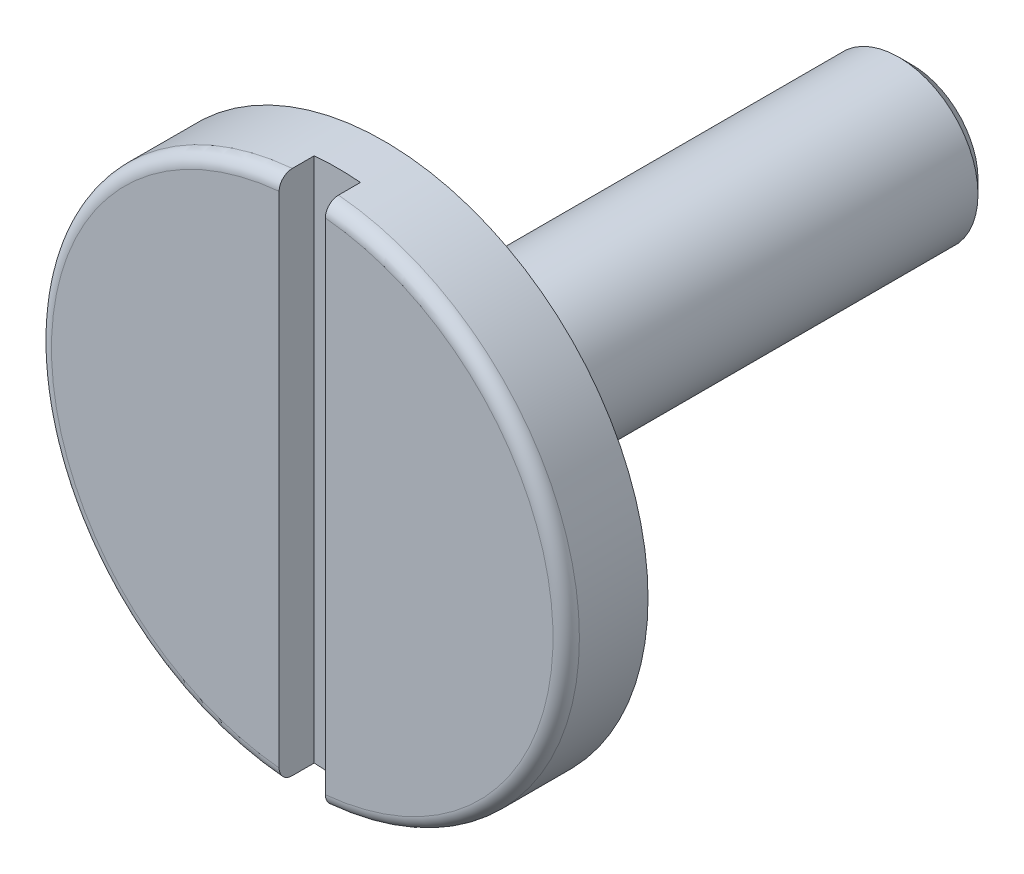
ISO-10303-21;
HEADER;
FILE_DESCRIPTION(('STEP AP214'),'2;1');
FILE_NAME('part.step','',(''),(''),'','','');
FILE_SCHEMA(('AUTOMOTIVE_DESIGN { 1 0 10303 214 1 1 1 1 }'));
ENDSEC;
DATA;
#1=APPLICATION_CONTEXT('core data for automotive mechanical design processes');
#2=APPLICATION_PROTOCOL_DEFINITION('international standard','automotive_design',2000,#1);
#3=PRODUCT_CONTEXT('',#1,'mechanical');
#4=PRODUCT('Part','Part','',(#3));
#5=PRODUCT_RELATED_PRODUCT_CATEGORY('part','',(#4));
#6=PRODUCT_DEFINITION_FORMATION('','',#4);
#7=PRODUCT_DEFINITION_CONTEXT('part definition',#1,'design');
#8=PRODUCT_DEFINITION('design','',#6,#7);
#9=PRODUCT_DEFINITION_SHAPE('','',#8);
#10=(LENGTH_UNIT() NAMED_UNIT(*) SI_UNIT(.MILLI.,.METRE.));
#11=(NAMED_UNIT(*) PLANE_ANGLE_UNIT() SI_UNIT($,.RADIAN.));
#12=(NAMED_UNIT(*) SI_UNIT($,.STERADIAN.) SOLID_ANGLE_UNIT());
#13=UNCERTAINTY_MEASURE_WITH_UNIT(LENGTH_MEASURE(1.E-05),#10,'distance_accuracy_value','');
#14=(GEOMETRIC_REPRESENTATION_CONTEXT(3) GLOBAL_UNCERTAINTY_ASSIGNED_CONTEXT((#13)) GLOBAL_UNIT_ASSIGNED_CONTEXT((#10,
#11,#12)) REPRESENTATION_CONTEXT('',''));
#15=CARTESIAN_POINT('',(0.,0.,0.));
#16=DIRECTION('',(0.,0.,1.));
#17=DIRECTION('',(1.,0.,0.));
#18=AXIS2_PLACEMENT_3D('',#15,#16,#17);
#19=CARTESIAN_POINT('',(0.,0.,3.1));
#20=DIRECTION('',(0.,0.,-1.));
#21=DIRECTION('',(-1.,0.,0.));
#22=AXIS2_PLACEMENT_3D('',#19,#20,#21);
#23=PLANE('',#22);
#24=DIRECTION('',(0.,1.,0.));
#25=VECTOR('',#24,1.);
#26=CARTESIAN_POINT('',(0.875000000000002,-9.96164519544839,3.1));
#27=LINE('',#26,#25);
#28=CARTESIAN_POINT('',(0.874999999999999,9.45961812125627,3.1));
#29=VERTEX_POINT('',#28);
#30=CARTESIAN_POINT('',(0.875000000000001,-9.45961812125627,3.1));
#31=VERTEX_POINT('',#30);
#32=EDGE_CURVE('E78',#29,#31,#27,.F.);
#33=ORIENTED_EDGE('',*,*,#32,.T.);
#34=CARTESIAN_POINT('',(0.,0.,3.1));
#35=DIRECTION('',(0.,0.,-1.));
#36=DIRECTION('',(0.0921052631578945,0.995749275921713,0.));
#37=AXIS2_PLACEMENT_3D('',#34,#35,#36);
#38=CIRCLE('',#37,9.5);
#39=EDGE_CURVE('E90',#29,#31,#38,.T.);
#40=ORIENTED_EDGE('',*,*,#39,.F.);
#41=EDGE_LOOP('',(#33,#40));
#42=FACE_BOUND('',#41,.T.);
#43=ADVANCED_FACE('F15',(#42),#23,.F.);
#44=CARTESIAN_POINT('',(0.,0.,3.1));
#45=DIRECTION('',(0.,0.,-1.));
#46=DIRECTION('',(-1.,0.,0.));
#47=AXIS2_PLACEMENT_3D('',#44,#45,#46);
#48=PLANE('',#47);
#49=DIRECTION('',(0.,1.,0.));
#50=VECTOR('',#49,1.);
#51=CARTESIAN_POINT('',(-0.875000000000003,9.96164519544839,3.1));
#52=LINE('',#51,#50);
#53=CARTESIAN_POINT('',(-0.875000000000001,-9.45961812125627,3.1));
#54=VERTEX_POINT('',#53);
#55=CARTESIAN_POINT('',(-0.875000000000003,9.45961812125627,3.1));
#56=VERTEX_POINT('',#55);
#57=EDGE_CURVE('E69',#54,#56,#52,.T.);
#58=ORIENTED_EDGE('',*,*,#57,.T.);
#59=CARTESIAN_POINT('',(0.,0.,3.1));
#60=DIRECTION('',(0.,0.,-1.));
#61=DIRECTION('',(-0.0921052631578946,-0.995749275921713,0.));
#62=AXIS2_PLACEMENT_3D('',#59,#60,#61);
#63=CIRCLE('',#62,9.5);
#64=EDGE_CURVE('E146',#54,#56,#63,.T.);
#65=ORIENTED_EDGE('',*,*,#64,.F.);
#66=EDGE_LOOP('',(#58,#65));
#67=FACE_BOUND('',#66,.T.);
#68=ADVANCED_FACE('F151',(#67),#48,.F.);
#69=CARTESIAN_POINT('',(0.875000000000002,-9.96164519544839,3.1));
#70=DIRECTION('',(1.,0.,0.));
#71=DIRECTION('',(0.,0.,-1.));
#72=AXIS2_PLACEMENT_3D('',#69,#70,#71);
#73=PLANE('',#72);
#74=DIRECTION('',(0.,0.,-1.));
#75=VECTOR('',#74,1.);
#76=CARTESIAN_POINT('',(0.875000000000002,9.96164519544839,3.1));
#77=LINE('',#76,#75);
#78=CARTESIAN_POINT('',(0.875000000000002,9.96164519544839,1.77));
#79=VERTEX_POINT('',#78);
#80=CARTESIAN_POINT('',(0.875000000000001,9.96164519544839,2.6));
#81=VERTEX_POINT('',#80);
#82=EDGE_CURVE('E39',#79,#81,#77,.F.);
#83=ORIENTED_EDGE('',*,*,#82,.F.);
#84=DIRECTION('',(0.,1.,0.));
#85=VECTOR('',#84,1.);
#86=CARTESIAN_POINT('',(0.875000000000002,0.,1.77));
#87=LINE('',#86,#85);
#88=CARTESIAN_POINT('',(0.875000000000002,-9.96164519544839,1.77));
#89=VERTEX_POINT('',#88);
#90=EDGE_CURVE('E200',#89,#79,#87,.T.);
#91=ORIENTED_EDGE('',*,*,#90,.F.);
#92=DIRECTION('',(0.,0.,-1.));
#93=VECTOR('',#92,1.);
#94=CARTESIAN_POINT('',(0.875000000000002,-9.96164519544839,3.1));
#95=LINE('',#94,#93);
#96=CARTESIAN_POINT('',(0.875000000000004,-9.96164519544839,2.6));
#97=VERTEX_POINT('',#96);
#98=EDGE_CURVE('E88',#97,#89,#95,.T.);
#99=ORIENTED_EDGE('',*,*,#98,.F.);
#100=CARTESIAN_POINT('',(0.875,-9.45961812125627,3.1));
#101=CARTESIAN_POINT('',(0.875000000000738,-9.48794703213022,3.10002353735377));
#102=CARTESIAN_POINT('',(0.87500000000044,-9.51626965933769,3.09761422660844));
#103=CARTESIAN_POINT('',(0.874999999999565,-9.57209714343182,3.0881014517241));
#104=CARTESIAN_POINT('',(0.874999999998988,-9.59960252401443,3.08100106453784));
#105=CARTESIAN_POINT('',(0.874999999999346,-9.65304367864375,3.06227229782282));
#106=CARTESIAN_POINT('',(0.875000000000281,-9.67897861178497,3.05064151681156));
#107=CARTESIAN_POINT('',(0.874999999999723,-9.72851723708293,3.02318598945902));
#108=CARTESIAN_POINT('',(0.874999999998231,-9.75212142758174,3.00736214232483));
#109=CARTESIAN_POINT('',(0.874999999998479,-9.79628200801184,2.97199631232369));
#110=CARTESIAN_POINT('',(0.875000000000213,-9.81684423978009,2.95246162513349));
#111=CARTESIAN_POINT('',(0.874999999999791,-9.85438111181075,2.91020550095205));
#112=CARTESIAN_POINT('',(0.874999999997636,-9.87135593010147,2.88748422219116));
#113=CARTESIAN_POINT('',(0.874999999997825,-9.90117167292373,2.83958905671415));
#114=CARTESIAN_POINT('',(0.875000000000155,-9.91402701778687,2.8144241363582));
#115=CARTESIAN_POINT('',(0.874999999999849,-9.93530677214744,2.76229357758986));
#116=CARTESIAN_POINT('',(0.874999999997218,-9.94373402304016,2.73532910645484));
#117=CARTESIAN_POINT('',(0.874999999997662,-9.95375435926333,2.69015751267986));
#118=CARTESIAN_POINT('',(0.874999999999041,-9.95671165930196,2.67224132176447));
#119=CARTESIAN_POINT('',(0.875000000000961,-9.96065675374565,2.63621933188532));
#120=CARTESIAN_POINT('',(0.875000000001502,-9.96164735191317,2.61811383988958));
#121=CARTESIAN_POINT('',(0.875000000000007,-9.96164519544839,2.60000000000001));
#122=B_SPLINE_CURVE_WITH_KNOTS('',3,(#100,#101,#102,#103,#104,#105,#106,#107,#108,#109,#110,
#111,#112,#113,#114,#115,#116,#117,#118,#119,#120,#121),.UNSPECIFIED.,.F.,.F.,(4,2,2,2,2,2,2,2,
2,2,4),(0.,0.0848755954427187,0.169695574809206,0.25456057708415,0.339407394685175,
0.424089094519425,0.508766590967947,0.593144348713257,0.677467897073694,0.731843659457585,
0.786141847039047),.UNSPECIFIED.);
#123=EDGE_CURVE('E85',#31,#97,#122,.T.);
#124=ORIENTED_EDGE('',*,*,#123,.F.);
#125=ORIENTED_EDGE('',*,*,#32,.F.);
#126=CARTESIAN_POINT('',(0.875,9.96164519544839,2.6));
#127=CARTESIAN_POINT('',(0.875000000000003,9.96166951727,2.62804981859996));
#128=CARTESIAN_POINT('',(0.875000000000003,9.9592772046922,2.65609188700764));
#129=CARTESIAN_POINT('',(0.875000000000001,9.94983951248388,2.71135721970606));
#130=CARTESIAN_POINT('',(0.874999999999999,9.9427982806824,2.73858119129698));
#131=CARTESIAN_POINT('',(0.875,9.92423823906859,2.79147154113732));
#132=CARTESIAN_POINT('',(0.875000000000003,9.91271743965994,2.8171372214085));
#133=CARTESIAN_POINT('',(0.875000000000001,9.88554069307088,2.86617091219818));
#134=CARTESIAN_POINT('',(0.874999999999998,9.86988535217824,2.88953925890802));
#135=CARTESIAN_POINT('',(0.875000000000009,9.83485565060325,2.93336497990533));
#136=CARTESIAN_POINT('',(0.875000000000024,9.81547491969754,2.95381726200664));
#137=CARTESIAN_POINT('',(0.87499999999998,9.77356547207434,2.99119232559525));
#138=CARTESIAN_POINT('',(0.874999999999922,9.75103670370162,3.00811504915571));
#139=CARTESIAN_POINT('',(0.875000000000084,9.70337939877358,3.03802088902259));
#140=CARTESIAN_POINT('',(0.875000000000306,9.67824098253159,3.05098824356295));
#141=CARTESIAN_POINT('',(0.874999999999698,9.62615395533316,3.07253022659135));
#142=CARTESIAN_POINT('',(0.874999999998869,9.59920630228888,3.08110715919129));
#143=CARTESIAN_POINT('',(0.874999999999106,9.55335751097752,3.09156939508533));
#144=CARTESIAN_POINT('',(0.874999999999637,9.53473698640962,3.09472905226063));
#145=CARTESIAN_POINT('',(0.875000000000366,9.49728618011395,3.09894412897264));
#146=CARTESIAN_POINT('',(0.875000000000565,9.4784562347663,3.10000253795991));
#147=CARTESIAN_POINT('',(0.875,9.45961812125628,3.1));
#148=B_SPLINE_CURVE_WITH_KNOTS('',3,(#126,#127,#128,#129,#130,#131,#132,#133,#134,#135,#136,
#137,#138,#139,#140,#141,#142,#143,#144,#145,#146,#147),.UNSPECIFIED.,.F.,.F.,(4,2,2,2,2,2,2,2,
2,2,4),(0.,0.0840363990036681,0.167997920726342,0.251996776566993,0.335983321676738,
0.42011477791981,0.504247614813298,0.588711460220256,0.673130933082565,0.72968015961597,
0.786148875617127),.UNSPECIFIED.);
#149=EDGE_CURVE('E82',#81,#29,#148,.T.);
#150=ORIENTED_EDGE('',*,*,#149,.F.);
#151=EDGE_LOOP('',(#83,#91,#99,#124,#125,#150));
#152=FACE_BOUND('',#151,.T.);
#153=ADVANCED_FACE('F80',(#152),#73,.F.);
#154=CARTESIAN_POINT('',(-0.875000000000003,9.96164519544839,3.1));
#155=DIRECTION('',(-1.,0.,0.));
#156=DIRECTION('',(0.,0.,1.));
#157=AXIS2_PLACEMENT_3D('',#154,#155,#156);
#158=PLANE('',#157);
#159=DIRECTION('',(0.,0.,1.));
#160=VECTOR('',#159,1.);
#161=CARTESIAN_POINT('',(-0.875000000000003,-9.96164519544839,3.1));
#162=LINE('',#161,#160);
#163=CARTESIAN_POINT('',(-0.875000000000003,-9.96164519544839,1.77));
#164=VERTEX_POINT('',#163);
#165=CARTESIAN_POINT('',(-0.875000000000001,-9.96164519544839,2.6));
#166=VERTEX_POINT('',#165);
#167=EDGE_CURVE('E100',#164,#166,#162,.T.);
#168=ORIENTED_EDGE('',*,*,#167,.F.);
#169=DIRECTION('',(0.,1.,0.));
#170=VECTOR('',#169,1.);
#171=CARTESIAN_POINT('',(-0.875000000000003,0.,1.77));
#172=LINE('',#171,#170);
#173=CARTESIAN_POINT('',(-0.875000000000003,9.96164519544839,1.77));
#174=VERTEX_POINT('',#173);
#175=EDGE_CURVE('E132',#174,#164,#172,.F.);
#176=ORIENTED_EDGE('',*,*,#175,.F.);
#177=DIRECTION('',(0.,0.,1.));
#178=VECTOR('',#177,1.);
#179=CARTESIAN_POINT('',(-0.875000000000003,9.96164519544839,3.1));
#180=LINE('',#179,#178);
#181=CARTESIAN_POINT('',(-0.875000000000004,9.96164519544839,2.6));
#182=VERTEX_POINT('',#181);
#183=EDGE_CURVE('E134',#182,#174,#180,.F.);
#184=ORIENTED_EDGE('',*,*,#183,.F.);
#185=CARTESIAN_POINT('',(-0.875000000000002,9.45961812125627,3.1));
#186=CARTESIAN_POINT('',(-0.875000000000743,9.48794703213022,3.10002353735377));
#187=CARTESIAN_POINT('',(-0.875000000000443,9.51626965933769,3.09761422660844));
#188=CARTESIAN_POINT('',(-0.874999999999563,9.57209714343182,3.0881014517241));
#189=CARTESIAN_POINT('',(-0.874999999998984,9.59960252401443,3.08100106453784));
#190=CARTESIAN_POINT('',(-0.874999999999341,9.65304367864375,3.06227229782282));
#191=CARTESIAN_POINT('',(-0.875000000000279,9.67897861178497,3.05064151681156));
#192=CARTESIAN_POINT('',(-0.874999999999727,9.72851723708293,3.02318598945902));
#193=CARTESIAN_POINT('',(-0.874999999998238,9.75212142758174,3.00736214232483));
#194=CARTESIAN_POINT('',(-0.874999999998484,9.79628200801184,2.97199631232369));
#195=CARTESIAN_POINT('',(-0.875000000000214,9.81684423978009,2.95246162513349));
#196=CARTESIAN_POINT('',(-0.874999999999792,9.85438111181075,2.91020550095205));
#197=CARTESIAN_POINT('',(-0.874999999997642,9.87135593010147,2.88748422219116));
#198=CARTESIAN_POINT('',(-0.874999999997831,9.90117167292373,2.83958905671415));
#199=CARTESIAN_POINT('',(-0.875000000000155,9.91402701778686,2.8144241363582));
#200=CARTESIAN_POINT('',(-0.874999999999852,9.93530677214744,2.76229357758986));
#201=CARTESIAN_POINT('',(-0.874999999997228,9.94373402304016,2.73532910645484));
#202=CARTESIAN_POINT('',(-0.87499999999767,9.95375435926333,2.69015751267986));
#203=CARTESIAN_POINT('',(-0.874999999999046,9.95671165930196,2.67224132176447));
#204=CARTESIAN_POINT('',(-0.875000000000958,9.96065675374565,2.63621933188532));
#205=CARTESIAN_POINT('',(-0.875000000001495,9.96164735191317,2.61811383988958));
#206=CARTESIAN_POINT('',(-0.874999999999998,9.96164519544839,2.60000000000001));
#207=B_SPLINE_CURVE_WITH_KNOTS('',3,(#185,#186,#187,#188,#189,#190,#191,#192,#193,#194,#195,
#196,#197,#198,#199,#200,#201,#202,#203,#204,#205,#206),.UNSPECIFIED.,.F.,.F.,(4,2,2,2,2,2,2,2,
2,2,4),(0.,0.0848755954427187,0.169695574809206,0.254560577084148,0.339407394685173,
0.424089094519423,0.508766590967947,0.593144348713255,0.677467897073693,0.731843659457584,
0.786141847039046),.UNSPECIFIED.);
#208=EDGE_CURVE('E94',#56,#182,#207,.T.);
#209=ORIENTED_EDGE('',*,*,#208,.F.);
#210=ORIENTED_EDGE('',*,*,#57,.F.);
#211=CARTESIAN_POINT('',(-0.875,-9.96164519544839,2.6));
#212=CARTESIAN_POINT('',(-0.875000000000003,-9.96166951727,2.62804981859996));
#213=CARTESIAN_POINT('',(-0.875000000000003,-9.9592772046922,2.65609188700764));
#214=CARTESIAN_POINT('',(-0.875000000000003,-9.94983951248388,2.71135721970606));
#215=CARTESIAN_POINT('',(-0.875000000000002,-9.9427982806824,2.73858119129698));
#216=CARTESIAN_POINT('',(-0.875000000000002,-9.92423823906859,2.79147154113732));
#217=CARTESIAN_POINT('',(-0.875000000000003,-9.91271743965994,2.8171372214085));
#218=CARTESIAN_POINT('',(-0.875000000000003,-9.88554069307088,2.86617091219818));
#219=CARTESIAN_POINT('',(-0.875000000000003,-9.86988535217824,2.88953925890802));
#220=CARTESIAN_POINT('',(-0.875000000000015,-9.83485565060325,2.93336497990533));
#221=CARTESIAN_POINT('',(-0.875000000000028,-9.81547491969754,2.95381726200664));
#222=CARTESIAN_POINT('',(-0.874999999999978,-9.77356547207434,2.99119232559526));
#223=CARTESIAN_POINT('',(-0.874999999999914,-9.75103670370162,3.00811504915571));
#224=CARTESIAN_POINT('',(-0.875000000000077,-9.70337939877358,3.03802088902259));
#225=CARTESIAN_POINT('',(-0.875000000000305,-9.67824098253158,3.05098824356295));
#226=CARTESIAN_POINT('',(-0.874999999999702,-9.62615395533316,3.07253022659135));
#227=CARTESIAN_POINT('',(-0.874999999998872,-9.59920630228888,3.08110715919129));
#228=CARTESIAN_POINT('',(-0.874999999999108,-9.55335751097752,3.09156939508533));
#229=CARTESIAN_POINT('',(-0.874999999999639,-9.53473698640962,3.09472905226063));
#230=CARTESIAN_POINT('',(-0.875000000000367,-9.49728618011395,3.09894412897264));
#231=CARTESIAN_POINT('',(-0.875000000000564,-9.4784562347663,3.10000253795991));
#232=CARTESIAN_POINT('',(-0.874999999999995,-9.45961812125628,3.1));
#233=B_SPLINE_CURVE_WITH_KNOTS('',3,(#211,#212,#213,#214,#215,#216,#217,#218,#219,#220,#221,
#222,#223,#224,#225,#226,#227,#228,#229,#230,#231,#232),.UNSPECIFIED.,.F.,.F.,(4,2,2,2,2,2,2,2,
2,2,4),(0.,0.0840363990036681,0.167997920726342,0.251996776566994,0.335983321676739,
0.420114777919812,0.5042476148133,0.588711460220257,0.673130933082564,0.729680159615969,
0.786148875617127),.UNSPECIFIED.);
#234=EDGE_CURVE('E210',#166,#54,#233,.T.);
#235=ORIENTED_EDGE('',*,*,#234,.F.);
#236=EDGE_LOOP('',(#168,#176,#184,#209,#210,#235));
#237=FACE_BOUND('',#236,.T.);
#238=ADVANCED_FACE('F119',(#237),#158,.F.);
#239=CARTESIAN_POINT('',(0.,0.,2.6));
#240=DIRECTION('',(0.,0.,-1.));
#241=DIRECTION('',(-1.,0.,0.));
#242=AXIS2_PLACEMENT_3D('',#239,#240,#241);
#243=TOROIDAL_SURFACE('',#242,9.5,0.5);
#244=ORIENTED_EDGE('',*,*,#149,.T.);
#245=ORIENTED_EDGE('',*,*,#39,.T.);
#246=ORIENTED_EDGE('',*,*,#123,.T.);
#247=CARTESIAN_POINT('',(0.,0.,2.6));
#248=DIRECTION('',(0.,0.,1.));
#249=DIRECTION('',(1.,0.,0.));
#250=AXIS2_PLACEMENT_3D('',#247,#248,#249);
#251=CIRCLE('',#250,10.);
#252=EDGE_CURVE('E98',#81,#97,#251,.F.);
#253=ORIENTED_EDGE('',*,*,#252,.F.);
#254=EDGE_LOOP('',(#244,#245,#246,#253));
#255=FACE_BOUND('',#254,.T.);
#256=ADVANCED_FACE('F97',(#255),#243,.T.);
#257=CARTESIAN_POINT('',(0.,0.,2.6));
#258=DIRECTION('',(0.,0.,-1.));
#259=DIRECTION('',(-1.,0.,0.));
#260=AXIS2_PLACEMENT_3D('',#257,#258,#259);
#261=TOROIDAL_SURFACE('',#260,9.5,0.5);
#262=ORIENTED_EDGE('',*,*,#234,.T.);
#263=ORIENTED_EDGE('',*,*,#64,.T.);
#264=ORIENTED_EDGE('',*,*,#208,.T.);
#265=CARTESIAN_POINT('',(0.,0.,2.6));
#266=DIRECTION('',(0.,0.,1.));
#267=DIRECTION('',(1.,0.,0.));
#268=AXIS2_PLACEMENT_3D('',#265,#266,#267);
#269=CIRCLE('',#268,10.);
#270=EDGE_CURVE('E129',#166,#182,#269,.F.);
#271=ORIENTED_EDGE('',*,*,#270,.F.);
#272=EDGE_LOOP('',(#262,#263,#264,#271));
#273=FACE_BOUND('',#272,.T.);
#274=ADVANCED_FACE('F118',(#273),#261,.T.);
#275=CARTESIAN_POINT('',(0.,0.,1.77));
#276=DIRECTION('',(0.,0.,1.));
#277=DIRECTION('',(1.,0.,0.));
#278=AXIS2_PLACEMENT_3D('',#275,#276,#277);
#279=PLANE('',#278);
#280=CARTESIAN_POINT('',(0.,0.,1.77));
#281=DIRECTION('',(0.,0.,1.));
#282=DIRECTION('',(1.,0.,0.));
#283=AXIS2_PLACEMENT_3D('',#280,#281,#282);
#284=CIRCLE('',#283,10.);
#285=EDGE_CURVE('E196',#174,#79,#284,.F.);
#286=ORIENTED_EDGE('',*,*,#285,.F.);
#287=ORIENTED_EDGE('',*,*,#175,.T.);
#288=CARTESIAN_POINT('',(0.,0.,1.77));
#289=DIRECTION('',(0.,0.,1.));
#290=DIRECTION('',(1.,0.,0.));
#291=AXIS2_PLACEMENT_3D('',#288,#289,#290);
#292=CIRCLE('',#291,10.);
#293=EDGE_CURVE('E131',#89,#164,#292,.F.);
#294=ORIENTED_EDGE('',*,*,#293,.F.);
#295=ORIENTED_EDGE('',*,*,#90,.T.);
#296=EDGE_LOOP('',(#286,#287,#294,#295));
#297=FACE_BOUND('',#296,.T.);
#298=ADVANCED_FACE('F186',(#297),#279,.T.);
#299=CARTESIAN_POINT('',(0.,0.,0.));
#300=DIRECTION('',(0.,0.,1.));
#301=DIRECTION('',(1.,0.,0.));
#302=AXIS2_PLACEMENT_3D('',#299,#300,#301);
#303=CYLINDRICAL_SURFACE('',#302,10.);
#304=CARTESIAN_POINT('',(0.,0.,0.));
#305=DIRECTION('',(0.,0.,1.));
#306=DIRECTION('',(1.,0.,0.));
#307=AXIS2_PLACEMENT_3D('',#304,#305,#306);
#308=CIRCLE('',#307,10.);
#309=CARTESIAN_POINT('',(10.,0.,0.));
#310=VERTEX_POINT('',#309);
#311=EDGE_CURVE('E201',#310,#310,#308,.F.);
#312=ORIENTED_EDGE('',*,*,#311,.F.);
#313=EDGE_LOOP('',(#312));
#314=FACE_BOUND('',#313,.T.);
#315=ORIENTED_EDGE('',*,*,#285,.T.);
#316=ORIENTED_EDGE('',*,*,#82,.T.);
#317=ORIENTED_EDGE('',*,*,#252,.T.);
#318=ORIENTED_EDGE('',*,*,#98,.T.);
#319=ORIENTED_EDGE('',*,*,#293,.T.);
#320=ORIENTED_EDGE('',*,*,#167,.T.);
#321=ORIENTED_EDGE('',*,*,#270,.T.);
#322=ORIENTED_EDGE('',*,*,#183,.T.);
#323=EDGE_LOOP('',(#315,#316,#317,#318,#319,#320,#321,#322));
#324=FACE_BOUND('',#323,.T.);
#325=ADVANCED_FACE('F183',(#314,#324),#303,.T.);
#326=CARTESIAN_POINT('',(0.,0.,-20.));
#327=DIRECTION('',(0.,0.,1.));
#328=DIRECTION('',(1.,0.,0.));
#329=AXIS2_PLACEMENT_3D('',#326,#327,#328);
#330=PLANE('',#329);
#331=CARTESIAN_POINT('',(0.,0.,-20.0000000002092));
#332=DIRECTION('',(0.,0.,1.));
#333=DIRECTION('',(1.,0.,0.));
#334=AXIS2_PLACEMENT_3D('',#331,#332,#333);
#335=CIRCLE('',#334,2.5000000002251);
#336=CARTESIAN_POINT('',(2.5000000002251,0.,-20.0000000002092));
#337=VERTEX_POINT('',#336);
#338=EDGE_CURVE('E204',#337,#337,#335,.T.);
#339=ORIENTED_EDGE('',*,*,#338,.F.);
#340=EDGE_LOOP('',(#339));
#341=FACE_BOUND('',#340,.T.);
#342=ADVANCED_FACE('F179',(#341),#330,.F.);
#343=CARTESIAN_POINT('',(0.,0.,0.));
#344=DIRECTION('',(0.,0.,-1.));
#345=DIRECTION('',(-1.,0.,0.));
#346=AXIS2_PLACEMENT_3D('',#343,#344,#345);
#347=PLANE('',#346);
#348=CARTESIAN_POINT('',(0.,0.,0.));
#349=DIRECTION('',(0.,0.,-1.));
#350=DIRECTION('',(-1.,0.,0.));
#351=AXIS2_PLACEMENT_3D('',#348,#349,#350);
#352=CIRCLE('',#351,3.);
#353=CARTESIAN_POINT('',(-3.,0.,0.));
#354=VERTEX_POINT('',#353);
#355=EDGE_CURVE('E30',#354,#354,#352,.T.);
#356=ORIENTED_EDGE('',*,*,#355,.F.);
#357=EDGE_LOOP('',(#356));
#358=FACE_BOUND('',#357,.T.);
#359=ORIENTED_EDGE('',*,*,#311,.T.);
#360=EDGE_LOOP('',(#359));
#361=FACE_BOUND('',#360,.T.);
#362=ADVANCED_FACE('F172',(#358,#361),#347,.T.);
#363=CARTESIAN_POINT('',(0.,0.,-19.4999999997663));
#364=DIRECTION('',(0.,0.,1.));
#365=DIRECTION('',(1.,0.,0.));
#366=AXIS2_PLACEMENT_3D('',#363,#364,#365);
#367=CONICAL_SURFACE('',#366,2.99999999975853,0.785398162487954);
#368=CARTESIAN_POINT('',(0.,0.,-19.5));
#369=DIRECTION('',(0.,0.,-1.));
#370=DIRECTION('',(-1.,0.,0.));
#371=AXIS2_PLACEMENT_3D('',#368,#369,#370);
#372=CIRCLE('',#371,3.);
#373=CARTESIAN_POINT('',(-3.,0.,-19.5));
#374=VERTEX_POINT('',#373);
#375=EDGE_CURVE('E9',#374,#374,#372,.F.);
#376=ORIENTED_EDGE('',*,*,#375,.F.);
#377=EDGE_LOOP('',(#376));
#378=FACE_BOUND('',#377,.T.);
#379=ORIENTED_EDGE('',*,*,#338,.T.);
#380=EDGE_LOOP('',(#379));
#381=FACE_BOUND('',#380,.T.);
#382=ADVANCED_FACE('F166',(#378,#381),#367,.T.);
#383=CARTESIAN_POINT('',(0.,0.,0.));
#384=DIRECTION('',(0.,0.,-1.));
#385=DIRECTION('',(-1.,0.,0.));
#386=AXIS2_PLACEMENT_3D('',#383,#384,#385);
#387=CYLINDRICAL_SURFACE('',#386,3.);
#388=ORIENTED_EDGE('',*,*,#375,.T.);
#389=EDGE_LOOP('',(#388));
#390=FACE_BOUND('',#389,.T.);
#391=ORIENTED_EDGE('',*,*,#355,.T.);
#392=EDGE_LOOP('',(#391));
#393=FACE_BOUND('',#392,.T.);
#394=ADVANCED_FACE('F164',(#390,#393),#387,.T.);
#395=CLOSED_SHELL('',(#43,#68,#153,#238,#256,#274,#298,#325,#342,#362,#382,#394));
#396=MANIFOLD_SOLID_BREP('B1',#395);
#397=ADVANCED_BREP_SHAPE_REPRESENTATION('',(#18,#396),#14);
#398=SHAPE_DEFINITION_REPRESENTATION(#9,#397);
ENDSEC;
END-ISO-10303-21;
